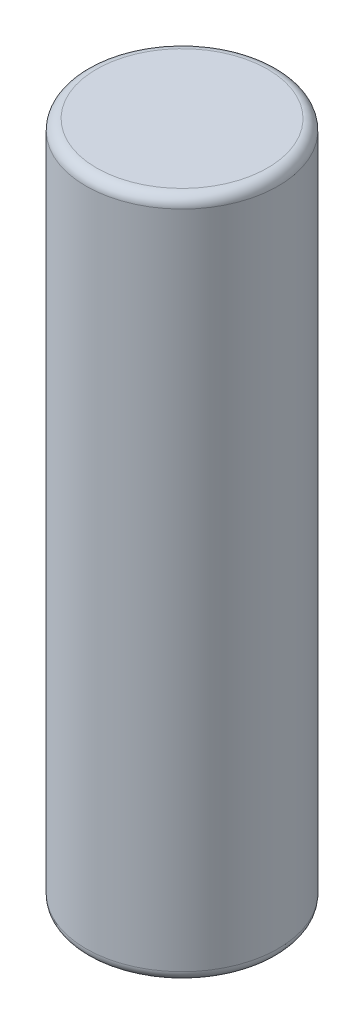
ISO-10303-21;
HEADER;
FILE_DESCRIPTION(('STEP AP214'),'2;1');
FILE_NAME('part.step','',(''),(''),'','','');
FILE_SCHEMA(('AUTOMOTIVE_DESIGN { 1 0 10303 214 1 1 1 1 }'));
ENDSEC;
DATA;
#1=APPLICATION_CONTEXT('core data for automotive mechanical design processes');
#2=APPLICATION_PROTOCOL_DEFINITION('international standard','automotive_design',2000,#1);
#3=PRODUCT_CONTEXT('',#1,'mechanical');
#4=PRODUCT('Part','Part','',(#3));
#5=PRODUCT_RELATED_PRODUCT_CATEGORY('part','',(#4));
#6=PRODUCT_DEFINITION_FORMATION('','',#4);
#7=PRODUCT_DEFINITION_CONTEXT('part definition',#1,'design');
#8=PRODUCT_DEFINITION('design','',#6,#7);
#9=PRODUCT_DEFINITION_SHAPE('','',#8);
#10=(LENGTH_UNIT() NAMED_UNIT(*) SI_UNIT(.MILLI.,.METRE.));
#11=(NAMED_UNIT(*) PLANE_ANGLE_UNIT() SI_UNIT($,.RADIAN.));
#12=(NAMED_UNIT(*) SI_UNIT($,.STERADIAN.) SOLID_ANGLE_UNIT());
#13=UNCERTAINTY_MEASURE_WITH_UNIT(LENGTH_MEASURE(1.E-05),#10,'distance_accuracy_value','');
#14=(GEOMETRIC_REPRESENTATION_CONTEXT(3) GLOBAL_UNCERTAINTY_ASSIGNED_CONTEXT((#13)) GLOBAL_UNIT_ASSIGNED_CONTEXT((#10,
#11,#12)) REPRESENTATION_CONTEXT('',''));
#15=CARTESIAN_POINT('',(0.,0.,0.));
#16=DIRECTION('',(0.,0.,1.));
#17=DIRECTION('',(1.,0.,0.));
#18=AXIS2_PLACEMENT_3D('',#15,#16,#17);
#19=CARTESIAN_POINT('',(0.,64.9,0.));
#20=DIRECTION('',(0.,-1.,0.));
#21=DIRECTION('',(0.,0.,-1.));
#22=AXIS2_PLACEMENT_3D('',#19,#20,#21);
#23=CYLINDRICAL_SURFACE('',#22,9.15);
#24=CARTESIAN_POINT('',(0.,63.9,0.));
#25=DIRECTION('',(0.,1.,0.));
#26=DIRECTION('',(0.,0.,1.));
#27=AXIS2_PLACEMENT_3D('',#24,#25,#26);
#28=CIRCLE('',#27,9.15);
#29=CARTESIAN_POINT('',(0.,63.9,9.15));
#30=VERTEX_POINT('',#29);
#31=EDGE_CURVE('E37',#30,#30,#28,.F.);
#32=ORIENTED_EDGE('',*,*,#31,.T.);
#33=EDGE_LOOP('',(#32));
#34=FACE_BOUND('',#33,.T.);
#35=CARTESIAN_POINT('',(0.,1.,0.));
#36=DIRECTION('',(0.,1.,0.));
#37=DIRECTION('',(0.,0.,1.));
#38=AXIS2_PLACEMENT_3D('',#35,#36,#37);
#39=CIRCLE('',#38,9.15);
#40=CARTESIAN_POINT('',(0.,1.,9.15));
#41=VERTEX_POINT('',#40);
#42=EDGE_CURVE('E41',#41,#41,#39,.T.);
#43=ORIENTED_EDGE('',*,*,#42,.T.);
#44=EDGE_LOOP('',(#43));
#45=FACE_BOUND('',#44,.T.);
#46=ADVANCED_FACE('F30',(#34,#45),#23,.T.);
#47=CARTESIAN_POINT('',(0.,64.9,0.));
#48=DIRECTION('',(0.,1.,0.));
#49=DIRECTION('',(0.,0.,1.));
#50=AXIS2_PLACEMENT_3D('',#47,#48,#49);
#51=PLANE('',#50);
#52=CARTESIAN_POINT('',(0.,64.9,0.));
#53=DIRECTION('',(0.,1.,0.));
#54=DIRECTION('',(0.,0.,1.));
#55=AXIS2_PLACEMENT_3D('',#52,#53,#54);
#56=CIRCLE('',#55,8.15);
#57=CARTESIAN_POINT('',(0.,64.9,8.15));
#58=VERTEX_POINT('',#57);
#59=EDGE_CURVE('E45',#58,#58,#56,.T.);
#60=ORIENTED_EDGE('',*,*,#59,.T.);
#61=EDGE_LOOP('',(#60));
#62=FACE_BOUND('',#61,.T.);
#63=ADVANCED_FACE('F51',(#62),#51,.T.);
#64=CARTESIAN_POINT('',(0.,0.,0.));
#65=DIRECTION('',(0.,1.,0.));
#66=DIRECTION('',(0.,0.,1.));
#67=AXIS2_PLACEMENT_3D('',#64,#65,#66);
#68=PLANE('',#67);
#69=CARTESIAN_POINT('',(0.,0.,0.));
#70=DIRECTION('',(0.,1.,0.));
#71=DIRECTION('',(0.,0.,1.));
#72=AXIS2_PLACEMENT_3D('',#69,#70,#71);
#73=CIRCLE('',#72,8.15);
#74=CARTESIAN_POINT('',(0.,0.,8.15));
#75=VERTEX_POINT('',#74);
#76=EDGE_CURVE('E10',#75,#75,#73,.F.);
#77=ORIENTED_EDGE('',*,*,#76,.T.);
#78=EDGE_LOOP('',(#77));
#79=FACE_BOUND('',#78,.T.);
#80=ADVANCED_FACE('F55',(#79),#68,.F.);
#81=CARTESIAN_POINT('',(0.,63.9,0.));
#82=DIRECTION('',(0.,1.,0.));
#83=DIRECTION('',(0.,0.,1.));
#84=AXIS2_PLACEMENT_3D('',#81,#82,#83);
#85=TOROIDAL_SURFACE('',#84,8.15,1.);
#86=ORIENTED_EDGE('',*,*,#31,.F.);
#87=EDGE_LOOP('',(#86));
#88=FACE_BOUND('',#87,.T.);
#89=ORIENTED_EDGE('',*,*,#59,.F.);
#90=EDGE_LOOP('',(#89));
#91=FACE_BOUND('',#90,.T.);
#92=ADVANCED_FACE('F53',(#88,#91),#85,.T.);
#93=CARTESIAN_POINT('',(0.,1.,0.));
#94=DIRECTION('',(0.,1.,0.));
#95=DIRECTION('',(0.,0.,1.));
#96=AXIS2_PLACEMENT_3D('',#93,#94,#95);
#97=TOROIDAL_SURFACE('',#96,8.15,1.);
#98=ORIENTED_EDGE('',*,*,#76,.F.);
#99=EDGE_LOOP('',(#98));
#100=FACE_BOUND('',#99,.T.);
#101=ORIENTED_EDGE('',*,*,#42,.F.);
#102=EDGE_LOOP('',(#101));
#103=FACE_BOUND('',#102,.T.);
#104=ADVANCED_FACE('F32',(#100,#103),#97,.T.);
#105=CLOSED_SHELL('',(#46,#63,#80,#92,#104));
#106=MANIFOLD_SOLID_BREP('B2',#105);
#107=ADVANCED_BREP_SHAPE_REPRESENTATION('',(#18,#106),#14);
#108=SHAPE_DEFINITION_REPRESENTATION(#9,#107);
ENDSEC;
END-ISO-10303-21;
